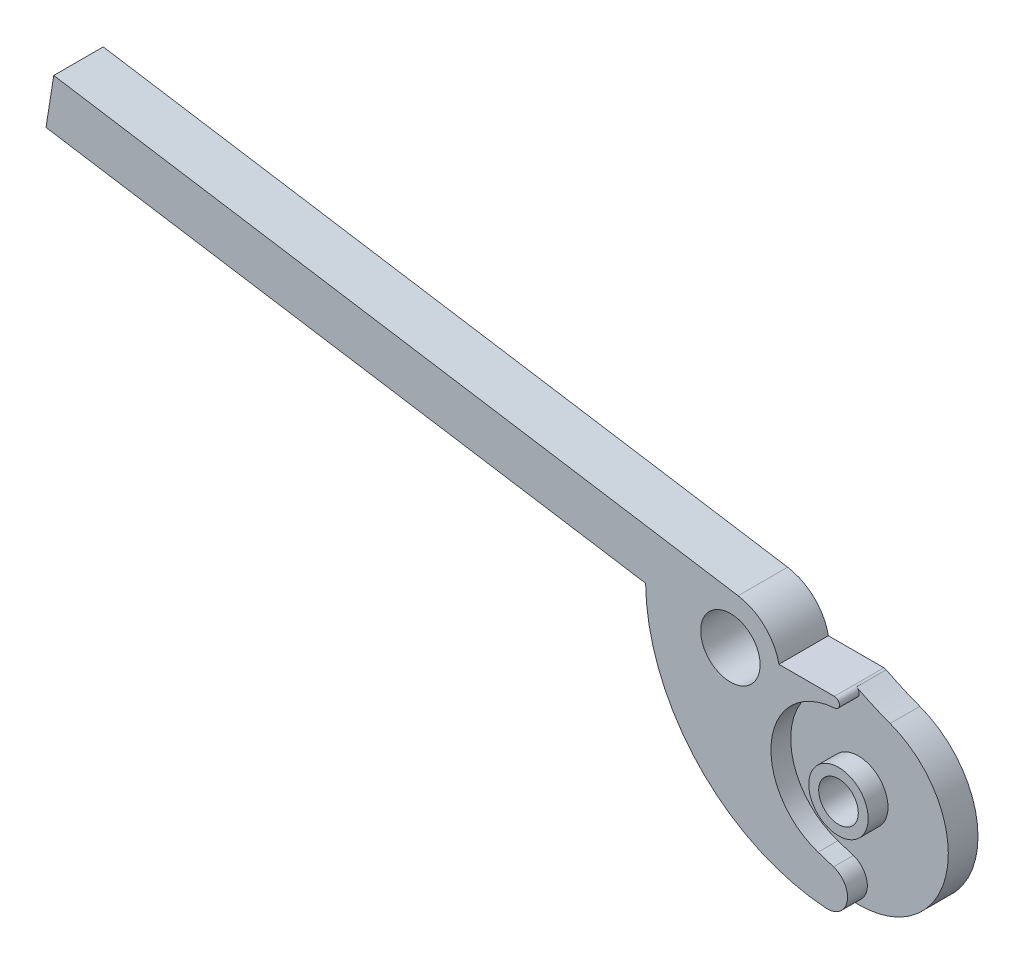
ISO-10303-21;
HEADER;
FILE_DESCRIPTION(('STEP AP214'),'2;1');
FILE_NAME('part.step','',(''),(''),'','','');
FILE_SCHEMA(('AUTOMOTIVE_DESIGN { 1 0 10303 214 1 1 1 1 }'));
ENDSEC;
DATA;
#1=APPLICATION_CONTEXT('core data for automotive mechanical design processes');
#2=APPLICATION_PROTOCOL_DEFINITION('international standard','automotive_design',2000,#1);
#3=PRODUCT_CONTEXT('',#1,'mechanical');
#4=PRODUCT('Part','Part','',(#3));
#5=PRODUCT_RELATED_PRODUCT_CATEGORY('part','',(#4));
#6=PRODUCT_DEFINITION_FORMATION('','',#4);
#7=PRODUCT_DEFINITION_CONTEXT('part definition',#1,'design');
#8=PRODUCT_DEFINITION('design','',#6,#7);
#9=PRODUCT_DEFINITION_SHAPE('','',#8);
#10=(LENGTH_UNIT() NAMED_UNIT(*) SI_UNIT(.MILLI.,.METRE.));
#11=(NAMED_UNIT(*) PLANE_ANGLE_UNIT() SI_UNIT($,.RADIAN.));
#12=(NAMED_UNIT(*) SI_UNIT($,.STERADIAN.) SOLID_ANGLE_UNIT());
#13=UNCERTAINTY_MEASURE_WITH_UNIT(LENGTH_MEASURE(1.E-05),#10,'distance_accuracy_value','');
#14=(GEOMETRIC_REPRESENTATION_CONTEXT(3) GLOBAL_UNCERTAINTY_ASSIGNED_CONTEXT((#13)) GLOBAL_UNIT_ASSIGNED_CONTEXT((#10,
#11,#12)) REPRESENTATION_CONTEXT('',''));
#15=CARTESIAN_POINT('',(0.,0.,0.));
#16=DIRECTION('',(0.,0.,1.));
#17=DIRECTION('',(1.,0.,0.));
#18=AXIS2_PLACEMENT_3D('',#15,#16,#17);
#19=CARTESIAN_POINT('',(10.5046799855272,1.,5.5));
#20=CARTESIAN_POINT('',(10.5046799855272,1.,5.33333333333337));
#21=CARTESIAN_POINT('',(10.5046799855272,1.,5.16666666666662));
#22=CARTESIAN_POINT('',(10.5046799855272,1.,4.33333333333353));
#23=CARTESIAN_POINT('',(10.5046799855257,1.,3.66666666666654));
#24=CARTESIAN_POINT('',(10.5046799855257,1.,2.00000000000019));
#25=CARTESIAN_POINT('',(10.5046799855272,1.,1.00000000000024));
#26=CARTESIAN_POINT('',(10.5046799855272,1.,-0.166666666666707));
#27=CARTESIAN_POINT('',(10.5046799855272,1.,-0.333333333333299));
#28=CARTESIAN_POINT('',(10.5046799855272,1.,-0.5));
#29=CARTESIAN_POINT('',(11.457550308396,1.,5.5));
#30=CARTESIAN_POINT('',(11.4575503083964,1.00000000000027,5.33333333333337));
#31=CARTESIAN_POINT('',(11.457550308396,1.,5.16666666666662));
#32=CARTESIAN_POINT('',(11.457550308396,1.,4.33333333333353));
#33=CARTESIAN_POINT('',(11.4575503083998,1.00000000000302,3.66666666666668));
#34=CARTESIAN_POINT('',(11.4575503083955,1.00000000000031,1.99999999999997));
#35=CARTESIAN_POINT('',(11.457550308396,1.,1.00000000000024));
#36=CARTESIAN_POINT('',(11.457550308396,1.,-0.166666666666707));
#37=CARTESIAN_POINT('',(11.457550308396,1.,-0.333333333333299));
#38=CARTESIAN_POINT('',(11.457550308396,1.,-0.5));
#39=CARTESIAN_POINT('',(11.4888094546071,0.047642547158838,5.5));
#40=CARTESIAN_POINT('',(11.4888094546075,0.0476425471586087,5.33333333333337));
#41=CARTESIAN_POINT('',(11.4888094546071,0.0476425471588407,5.16666666666662));
#42=CARTESIAN_POINT('',(11.4888094546071,0.0476425471588407,4.33333333333353));
#43=CARTESIAN_POINT('',(11.4888094546112,0.0476425471565166,3.66666666666668));
#44=CARTESIAN_POINT('',(11.4888094546069,0.0476425471588093,1.99999999999997));
#45=CARTESIAN_POINT('',(11.4888094546071,0.0476425471588407,0.999999999999809));
#46=CARTESIAN_POINT('',(11.4888094546071,0.0476425471588407,-0.166666666666635));
#47=CARTESIAN_POINT('',(11.4888094546071,0.047642547158838,-0.333333333333354));
#48=CARTESIAN_POINT('',(11.4888094546071,0.047642547158838,-0.5));
#49=CARTESIAN_POINT('',(10.5379900597574,-0.0148420956075897,5.5));
#50=CARTESIAN_POINT('',(10.5379900597574,-0.0148420956075897,5.33333333333337));
#51=CARTESIAN_POINT('',(10.5379900597574,-0.0148420956075897,5.16666666666662));
#52=CARTESIAN_POINT('',(10.5379900597574,-0.0148420956075897,4.33333333333353));
#53=CARTESIAN_POINT('',(10.537990059756,-0.014842095607679,3.66666666666654));
#54=CARTESIAN_POINT('',(10.537990059756,-0.014842095607679,2.00000000000019));
#55=CARTESIAN_POINT('',(10.5379900597574,-0.0148420956075897,0.999999999999809));
#56=CARTESIAN_POINT('',(10.5379900597574,-0.0148420956075897,-0.166666666666635));
#57=CARTESIAN_POINT('',(10.5379900597574,-0.0148420956075897,-0.333333333333354));
#58=CARTESIAN_POINT('',(10.5379900597574,-0.0148420956075897,-0.5));
#59=(BOUNDED_SURFACE() B_SPLINE_SURFACE(3,3,((#19,#20,#21,#22,#23,#24,#25,#26,#27,#28),(#29,#30,
#31,#32,#33,#34,#35,#36,#37,#38),(#39,#40,#41,#42,#43,#44,#45,#46,#47,#48),(#49,#50,#51,#52,#53,
#54,#55,#56,#57,#58)),.UNSPECIFIED.,.F.,.F.,.F.) B_SPLINE_SURFACE_WITH_KNOTS((4,4),(4,2,2,2,4),
(0.,1.),(-0.1,0.,0.4,1.,1.1),
.UNSPECIFIED.) GEOMETRIC_REPRESENTATION_ITEM() RATIONAL_B_SPLINE_SURFACE(((1.,1.,1.,1.,1.,1.,1.,
1.,1.,1.),(0.355203497937325,0.355203497937325,0.355203497937328,0.355203497937328,
0.355203497936103,0.355203497936103,0.355203497937328,0.355203497937328,0.355203497937325,
0.355203497937325),(0.355203497937325,0.355203497937325,0.355203497937328,0.355203497937328,
0.355203497936103,0.355203497936103,0.355203497937328,0.355203497937328,0.355203497937325,
0.355203497937325),(1.,1.,1.,1.,1.,1.,1.,1.,1.,1.))) REPRESENTATION_ITEM('') SURFACE());
#60=CARTESIAN_POINT('',(11.0126477001718,0.492032285355068,3.));
#61=CARTESIAN_POINT('',(11.0126720461336,0.520613569163821,3.));
#62=CARTESIAN_POINT('',(11.0102369510657,0.54918761351215,3.));
#63=CARTESIAN_POINT('',(11.0006285792469,0.605497666315707,3.));
#64=CARTESIAN_POINT('',(10.9934603071358,0.633234527611298,3.));
#65=CARTESIAN_POINT('',(10.9745620272241,0.687120499637045,3.));
#66=CARTESIAN_POINT('',(10.9628303017176,0.713269008213628,3.));
#67=CARTESIAN_POINT('',(10.9351405105057,0.763233953696368,3.));
#68=CARTESIAN_POINT('',(10.9191811647579,0.787049681284518,3.));
#69=CARTESIAN_POINT('',(10.8834804284271,0.831678055350861,3.));
#70=CARTESIAN_POINT('',(10.8637363997762,0.852488589249073,3.));
#71=CARTESIAN_POINT('',(10.8210566125792,0.890466626632306,3.));
#72=CARTESIAN_POINT('',(10.79812634039,0.907640266804967,3.));
#73=CARTESIAN_POINT('',(10.7623936414455,0.92998468909038,3.));
#74=CARTESIAN_POINT('',(10.750560128675,0.936738193239441,3.));
#75=CARTESIAN_POINT('',(10.7384789972324,0.942997052545422,3.));
#76=B_SPLINE_CURVE_WITH_KNOTS('',3,(#60,#61,#62,#63,#64,#65,#66,#67,#68,#69,#70,#71,#72,#73,#74,
#75),.UNSPECIFIED.,.F.,.F.,(4,2,2,2,2,2,2,4),(0.,0.085629934450926,0.171169472494531,
0.256741239237436,0.342338945145626,0.427996534308549,0.513508417367527,0.554336598478728),.UNSPECIFIED.);
#77=CARTESIAN_POINT('',(11.0126477001721,0.492032285355068,3.));
#78=VERTEX_POINT('',#77);
#79=CARTESIAN_POINT('',(10.7384789972323,0.942997052545513,3.));
#80=VERTEX_POINT('',#79);
#81=EDGE_CURVE('E57',#78,#80,#76,.T.);
#82=CARTESIAN_POINT('',(14.1358177985421,-0.559276776445756,-1.74999999999511));
#83=CARTESIAN_POINT('',(12.3905553142359,0.0864915375277733,-1.74999999999511));
#84=CARTESIAN_POINT('',(10.7384789972327,0.942997052545537,-1.74999999999511));
#85=CARTESIAN_POINT('',(14.1358177985421,-0.559276776445756,-1.33333333394917));
#86=CARTESIAN_POINT('',(12.3905553142359,0.0864915375277733,-1.33333333394917));
#87=CARTESIAN_POINT('',(10.7384789972327,0.942997052545537,-1.33333333394917));
#88=CARTESIAN_POINT('',(14.1358177985421,-0.559276776445756,-0.916666667903218));
#89=CARTESIAN_POINT('',(12.3905553142359,0.0864915375277733,-0.916666667903218));
#90=CARTESIAN_POINT('',(10.7384789972327,0.942997052545536,-0.916666667903218));
#91=CARTESIAN_POINT('',(14.1358177985421,-0.559276776445756,-0.50000000185727));
#92=CARTESIAN_POINT('',(12.3905553142359,0.0864915375277733,-0.50000000185727));
#93=CARTESIAN_POINT('',(10.7384789972327,0.942997052545535,-0.50000000185727));
#94=CARTESIAN_POINT('',(14.1358177985421,-0.559276776445761,-0.37500000123634));
#95=CARTESIAN_POINT('',(12.3905553142359,0.086491537527771,-0.375000001236232));
#96=CARTESIAN_POINT('',(10.7384789972327,0.942997052545535,-0.375000001236125));
#97=CARTESIAN_POINT('',(14.1358177985421,-0.559276776445761,-0.250000000615409));
#98=CARTESIAN_POINT('',(12.3905553142359,0.0864915375277712,-0.250000000615322));
#99=CARTESIAN_POINT('',(10.7384789972327,0.942997052545536,-0.250000000615235));
#100=CARTESIAN_POINT('',(14.135817798542,-0.559276776445734,0.416666666672484));
#101=CARTESIAN_POINT('',(12.3905553142358,0.0864915375277826,0.41666666667198));
#102=CARTESIAN_POINT('',(10.7384789972326,0.942997052545543,0.416666666671479));
#103=CARTESIAN_POINT('',(14.1358177985417,-0.559276776445626,0.958333333339447));
#104=CARTESIAN_POINT('',(12.3905553142355,0.0864915375278278,0.958333333336759));
#105=CARTESIAN_POINT('',(10.7384789972322,0.942997052545564,0.958333333334092));
#106=CARTESIAN_POINT('',(14.1358177985413,-0.559276776445486,2.13558266072813));
#107=CARTESIAN_POINT('',(12.390555314235,0.0864915375278828,2.1355826607236));
#108=CARTESIAN_POINT('',(10.7384789972317,0.942997052545577,2.1355826607191));
#109=CARTESIAN_POINT('',(14.1358177985413,-0.559276776445471,2.77116532144985));
#110=CARTESIAN_POINT('',(12.390555314235,0.0864915375278851,2.77116532144616));
#111=CARTESIAN_POINT('',(10.7384789972317,0.942997052545564,2.77116532144249));
#112=CARTESIAN_POINT('',(14.135817798542,-0.559276776445725,3.40674798217157));
#113=CARTESIAN_POINT('',(12.3905553142358,0.0864915375277699,3.40674798217546));
#114=CARTESIAN_POINT('',(10.7384789972327,0.942997052545485,3.40674798217932));
#115=(BOUNDED_SURFACE() B_SPLINE_SURFACE(3,2,((#82,#83,#84),(#85,#86,#87),(#88,#89,#90),(#91,
#92,#93),(#94,#95,#96),(#97,#98,#99),(#100,#101,#102),(#103,#104,#105),(#106,#107,#108),(#109,
#110,#111),(#112,#113,#114)),.UNSPECIFIED.,.F.,.F.,.F.) B_SPLINE_SURFACE_WITH_KNOTS((4,3,2,2,4),
(3,3),(0.,1.24999999813784,1.62500000000063,3.25000000000152,5.15674798216669),(0.,1.),
.UNSPECIFIED.) GEOMETRIC_REPRESENTATION_ITEM() RATIONAL_B_SPLINE_SURFACE(((1.,0.998081668670768,
1.),(1.,0.998081668670768,1.),(1.,0.998081668670768,1.),(1.,0.998081668670768,1.),(1.,
0.998081668670768,1.),(1.,0.998081668670768,1.),(1.,0.998081668670768,1.),(1.,0.998081668670767,
1.),(1.,0.998081668670767,1.),(1.,0.998081668670767,1.),(1.,0.998081668670768,1.))) REPRESENTATION_ITEM('') SURFACE());
#116=CARTESIAN_POINT('',(10.7384789972327,0.942997052545485,3.40674798217932));
#117=CARTESIAN_POINT('',(10.7384789972317,0.942997052545564,2.77116532144249));
#118=CARTESIAN_POINT('',(10.7384789972317,0.942997052545577,2.1355826607191));
#119=CARTESIAN_POINT('',(10.7384789972322,0.942997052545564,0.958333333334092));
#120=CARTESIAN_POINT('',(10.7384789972326,0.942997052545544,0.416666666671479));
#121=CARTESIAN_POINT('',(10.7384789972327,0.942997052545536,-0.250000000615235));
#122=CARTESIAN_POINT('',(10.7384789972327,0.942997052545535,-0.375000001236125));
#123=CARTESIAN_POINT('',(10.7384789972327,0.942997052545535,-0.50000000185727));
#124=CARTESIAN_POINT('',(10.7384789972327,0.942997052545536,-0.916666667903218));
#125=CARTESIAN_POINT('',(10.7384789972327,0.942997052545537,-1.33333333394917));
#126=CARTESIAN_POINT('',(10.7384789972327,0.942997052545537,-1.74999999999511));
#127=B_SPLINE_CURVE_WITH_KNOTS('',3,(#116,#117,#118,#119,#120,#121,#122,#123,#124,#125,#126),
.UNSPECIFIED.,.F.,.F.,(4,2,2,3,4),(0.,1.90674798216516,3.53174798216605,3.90674798402884,
5.15674798216669),.UNSPECIFIED.);
#128=CARTESIAN_POINT('',(10.738748516728,0.943498579805578,0.));
#129=VERTEX_POINT('',#128);
#130=EDGE_CURVE('E305',#80,#129,#127,.T.);
#131=CARTESIAN_POINT('',(10.5379900597574,-0.0148420956075897,0.));
#132=CARTESIAN_POINT('',(11.4888094546071,0.0476425471588407,0.));
#133=CARTESIAN_POINT('',(11.457550308396,1.,0.));
#134=CARTESIAN_POINT('',(10.5046799855272,1.,0.));
#135=(BOUNDED_CURVE() B_SPLINE_CURVE(3,(#131,#132,#133,#134),.UNSPECIFIED.,.F.,
.F.) B_SPLINE_CURVE_WITH_KNOTS((4,4),(0.,1.),
.UNSPECIFIED.) CURVE() GEOMETRIC_REPRESENTATION_ITEM() RATIONAL_B_SPLINE_CURVE((1.,
0.355203497937328,0.355203497937328,1.)) REPRESENTATION_ITEM(''));
#136=CARTESIAN_POINT('',(10.5046799855272,1.,0.));
#137=VERTEX_POINT('',#136);
#138=EDGE_CURVE('E329',#137,#129,#135,.F.);
#139=CARTESIAN_POINT('',(10.5046799855272,1.,-0.5));
#140=CARTESIAN_POINT('',(10.5046799855272,1.,-0.333333333333299));
#141=CARTESIAN_POINT('',(10.5046799855272,1.,-0.166666666666707));
#142=CARTESIAN_POINT('',(10.5046799855272,1.,1.00000000000024));
#143=CARTESIAN_POINT('',(10.5046799855257,1.,2.00000000000019));
#144=CARTESIAN_POINT('',(10.5046799855257,1.,3.66666666666654));
#145=CARTESIAN_POINT('',(10.5046799855272,1.,4.33333333333353));
#146=CARTESIAN_POINT('',(10.5046799855272,1.,5.16666666666662));
#147=CARTESIAN_POINT('',(10.5046799855272,1.,5.33333333333337));
#148=CARTESIAN_POINT('',(10.5046799855272,1.,5.5));
#149=(BOUNDED_CURVE() B_SPLINE_CURVE(3,(#139,#140,#141,#142,#143,#144,#145,#146,#147,#148),
.UNSPECIFIED.,.F.,.F.) B_SPLINE_CURVE_WITH_KNOTS((4,2,2,2,4),(-0.1,0.,0.6,1.,1.1),
.UNSPECIFIED.) CURVE() GEOMETRIC_REPRESENTATION_ITEM() RATIONAL_B_SPLINE_CURVE((1.,1.,1.,1.,1.,
1.,1.,1.,1.,1.)) REPRESENTATION_ITEM(''));
#150=CARTESIAN_POINT('',(10.5046799855272,1.,5.));
#151=VERTEX_POINT('',#150);
#152=EDGE_CURVE('E239',#151,#137,#149,.F.);
#153=CARTESIAN_POINT('',(10.5046799855272,1.,5.));
#154=CARTESIAN_POINT('',(11.457550308396,1.,5.));
#155=CARTESIAN_POINT('',(11.4888094546071,0.0476425471588407,5.));
#156=CARTESIAN_POINT('',(10.5379900597574,-0.0148420956075897,5.));
#157=(BOUNDED_CURVE() B_SPLINE_CURVE(3,(#153,#154,#155,#156),.UNSPECIFIED.,.F.,
.F.) B_SPLINE_CURVE_WITH_KNOTS((4,4),(0.,1.),
.UNSPECIFIED.) CURVE() GEOMETRIC_REPRESENTATION_ITEM() RATIONAL_B_SPLINE_CURVE((1.,
0.355203497937328,0.355203497937328,1.)) REPRESENTATION_ITEM(''));
#158=CARTESIAN_POINT('',(10.5379900597574,-0.0148420956075906,5.));
#159=VERTEX_POINT('',#158);
#160=EDGE_CURVE('E328',#159,#151,#157,.F.);
#161=CARTESIAN_POINT('',(10.5379900597574,-0.0148420956075897,5.5));
#162=CARTESIAN_POINT('',(10.5379900597574,-0.0148420956075897,5.33333333333337));
#163=CARTESIAN_POINT('',(10.5379900597574,-0.0148420956075897,5.16666666666662));
#164=CARTESIAN_POINT('',(10.5379900597574,-0.0148420956075897,4.33333333333353));
#165=CARTESIAN_POINT('',(10.537990059756,-0.014842095607679,3.66666666666654));
#166=CARTESIAN_POINT('',(10.537990059756,-0.014842095607679,2.00000000000019));
#167=CARTESIAN_POINT('',(10.5379900597574,-0.0148420956075897,0.999999999999809));
#168=CARTESIAN_POINT('',(10.5379900597574,-0.0148420956075897,-0.166666666666635));
#169=CARTESIAN_POINT('',(10.5379900597574,-0.0148420956075897,-0.333333333333354));
#170=CARTESIAN_POINT('',(10.5379900597574,-0.0148420956075897,-0.5));
#171=(BOUNDED_CURVE() B_SPLINE_CURVE(3,(#161,#162,#163,#164,#165,#166,#167,#168,#169,#170),
.UNSPECIFIED.,.F.,.F.) B_SPLINE_CURVE_WITH_KNOTS((4,2,2,2,4),(-0.1,0.,0.4,1.,1.1),
.UNSPECIFIED.) CURVE() GEOMETRIC_REPRESENTATION_ITEM() RATIONAL_B_SPLINE_CURVE((1.,1.,1.,1.,1.,
1.,1.,1.,1.,1.)) REPRESENTATION_ITEM(''));
#172=CARTESIAN_POINT('',(10.537990059756,-0.0148420956076799,3.));
#173=VERTEX_POINT('',#172);
#174=EDGE_CURVE('E190',#173,#159,#171,.F.);
#175=CARTESIAN_POINT('',(10.537990059756,-0.014842095607679,3.));
#176=CARTESIAN_POINT('',(11.4888094546095,0.0476425471574337,3.));
#177=CARTESIAN_POINT('',(11.4575503083981,1.00000000000194,3.));
#178=CARTESIAN_POINT('',(10.5046799855257,1.,3.));
#179=(BOUNDED_CURVE() B_SPLINE_CURVE(3,(#175,#176,#177,#178),.UNSPECIFIED.,.F.,
.F.) B_SPLINE_CURVE_WITH_KNOTS((4,4),(0.,1.),
.UNSPECIFIED.) CURVE() GEOMETRIC_REPRESENTATION_ITEM() RATIONAL_B_SPLINE_CURVE((1.,
0.355203497936103,0.355203497936103,1.)) REPRESENTATION_ITEM(''));
#180=EDGE_CURVE('E146',#78,#173,#179,.F.);
#181=ORIENTED_EDGE('',*,*,#81,.T.);
#182=ORIENTED_EDGE('',*,*,#130,.T.);
#183=ORIENTED_EDGE('',*,*,#138,.F.);
#184=ORIENTED_EDGE('',*,*,#152,.F.);
#185=ORIENTED_EDGE('',*,*,#160,.F.);
#186=ORIENTED_EDGE('',*,*,#174,.F.);
#187=ORIENTED_EDGE('',*,*,#180,.F.);
#188=EDGE_LOOP('',(#181,#182,#183,#184,#185,#186,#187));
#189=FACE_BOUND('',#188,.T.);
#190=ADVANCED_FACE('F37',(#189),#59,.T.);
#191=CARTESIAN_POINT('',(9.64478065841801,-17.9521633593195,0.599999999999996));
#192=CARTESIAN_POINT('',(9.64478066003469,-17.9521633594327,0.733333333333266));
#193=CARTESIAN_POINT('',(9.64478057665277,-17.9521633535936,0.866666666666747));
#194=CARTESIAN_POINT('',(9.64478058635408,-17.952163354273,1.66666666666625));
#195=CARTESIAN_POINT('',(9.64478070850488,-17.9521633628271,2.33333333333006));
#196=CARTESIAN_POINT('',(9.64478072467374,-17.9521633639594,3.66666666666994));
#197=CARTESIAN_POINT('',(9.64478070850496,-17.9521633628271,4.33333333333288));
#198=CARTESIAN_POINT('',(9.64478071820618,-17.9521633635064,5.13333333333342));
#199=CARTESIAN_POINT('',(9.64478071497263,-17.95216336328,5.2666666666666));
#200=CARTESIAN_POINT('',(9.64478071658931,-17.9521633633932,5.4));
#201=CARTESIAN_POINT('',(12.9059484225558,-18.1805399077442,0.599999999999996));
#202=CARTESIAN_POINT('',(12.9059484218212,-18.1805399058975,0.733333333333267));
#203=CARTESIAN_POINT('',(12.9059484597145,-18.180540001153,0.866666666503238));
#204=CARTESIAN_POINT('',(12.9059484553055,-18.1805399900674,1.66666666257853));
#205=CARTESIAN_POINT('',(12.9059483997936,-18.1805398505274,2.33333332924205));
#206=CARTESIAN_POINT('',(12.9059483924453,-18.1805398320514,3.66666666258192));
#207=CARTESIAN_POINT('',(12.9059483997925,-18.1805398505262,4.33333332924624));
#208=CARTESIAN_POINT('',(12.9059483953849,-18.180539839442,5.13333333316996));
#209=CARTESIAN_POINT('',(12.9059483968533,-18.1805398431361,5.2666666666666));
#210=CARTESIAN_POINT('',(12.9059483961196,-18.1805398412895,5.4));
#211=CARTESIAN_POINT('',(13.5298957680896,-14.9714807499354,0.599999999999996));
#212=CARTESIAN_POINT('',(13.5298957664414,-14.9714807501562,0.733333333333288));
#213=CARTESIAN_POINT('',(13.5298958514687,-14.9714807387453,0.866666666503209));
#214=CARTESIAN_POINT('',(13.5298958415731,-14.9714807400706,1.66666666257868));
#215=CARTESIAN_POINT('',(13.5298957170173,-14.9714807567913,2.3333333292448));
#216=CARTESIAN_POINT('',(13.5298957005235,-14.9714807590025,3.66666666257918));
#217=CARTESIAN_POINT('',(13.529895717015,-14.9714807567936,4.33333332924624));
#218=CARTESIAN_POINT('',(13.5298957071215,-14.9714807581176,5.13333333316996));
#219=CARTESIAN_POINT('',(13.5298957104184,-14.9714807576762,5.2666666666666));
#220=CARTESIAN_POINT('',(13.5298957087705,-14.9714807578969,5.4));
#221=CARTESIAN_POINT('',(10.4207450862522,-13.9612564820859,0.599999999999996));
#222=CARTESIAN_POINT('',(10.4207450871871,-13.9612564823897,0.733333333333309));
#223=CARTESIAN_POINT('',(10.4207450389671,-13.9612564667221,0.866666666666689));
#224=CARTESIAN_POINT('',(10.4207450445745,-13.961256468544,1.66666666666654));
#225=CARTESIAN_POINT('',(10.4207451152204,-13.9612564914982,2.33333333333353));
#226=CARTESIAN_POINT('',(10.420745124566,-13.9612564945348,3.66666666666647));
#227=CARTESIAN_POINT('',(10.4207451152204,-13.9612564914982,4.33333333333288));
#228=CARTESIAN_POINT('',(10.4207451208278,-13.9612564933202,5.13333333333342));
#229=CARTESIAN_POINT('',(10.4207451189588,-13.9612564927129,5.2666666666666));
#230=CARTESIAN_POINT('',(10.4207451198932,-13.9612564930165,5.4));
#231=(BOUNDED_SURFACE() B_SPLINE_SURFACE(3,3,((#191,#192,#193,#194,#195,#196,#197,#198,#199,
#200),(#201,#202,#203,#204,#205,#206,#207,#208,#209,#210),(#211,#212,#213,#214,#215,#216,#217,
#218,#219,#220),(#221,#222,#223,#224,#225,#226,#227,#228,#229,#230)),.UNSPECIFIED.,.F.,.F.,
.F.) B_SPLINE_SURFACE_WITH_KNOTS((4,4),(4,2,2,2,4),(0.,1.),(-1.2,-1.,0.,1.,1.2),
.UNSPECIFIED.) GEOMETRIC_REPRESENTATION_ITEM() RATIONAL_B_SPLINE_SURFACE(((1.,1.,1.,1.,1.,1.,1.,
1.,1.,1.),(0.414545892180012,0.414545892180012,0.414545879073667,0.41454588212385,
0.414545898781575,0.414545903865582,0.414545898782426,0.414545901831809,0.414545901323565,
0.414545901323565),(0.414545892180012,0.414545892180012,0.414545879073667,0.41454588212385,
0.414545898781575,0.414545903865582,0.414545898782426,0.414545901831809,0.414545901323565,
0.414545901323565),(1.,1.,1.,1.,1.,1.,1.,1.,1.,1.))) REPRESENTATION_ITEM('') SURFACE());
#232=CARTESIAN_POINT('',(10.4207450862522,-13.9612564820859,0.599999999999996));
#233=CARTESIAN_POINT('',(10.4207450871871,-13.9612564823897,0.733333333333309));
#234=CARTESIAN_POINT('',(10.4207450389671,-13.9612564667221,0.866666666666689));
#235=CARTESIAN_POINT('',(10.4207450445745,-13.961256468544,1.66666666666654));
#236=CARTESIAN_POINT('',(10.4207451152204,-13.9612564914982,2.33333333333353));
#237=CARTESIAN_POINT('',(10.420745124566,-13.9612564945348,3.66666666666647));
#238=CARTESIAN_POINT('',(10.4207451152204,-13.9612564914982,4.33333333333288));
#239=CARTESIAN_POINT('',(10.4207451208278,-13.9612564933202,5.13333333333342));
#240=CARTESIAN_POINT('',(10.4207451189588,-13.9612564927129,5.2666666666666));
#241=CARTESIAN_POINT('',(10.4207451198932,-13.9612564930165,5.4));
#242=(BOUNDED_CURVE() B_SPLINE_CURVE(3,(#232,#233,#234,#235,#236,#237,#238,#239,#240,#241),
.UNSPECIFIED.,.F.,.F.) B_SPLINE_CURVE_WITH_KNOTS((4,2,2,2,4),(-1.2,-1.,0.,1.,1.2),
.UNSPECIFIED.) CURVE() GEOMETRIC_REPRESENTATION_ITEM() RATIONAL_B_SPLINE_CURVE((1.,1.,1.,1.,1.,
1.,1.,1.,1.,1.)) REPRESENTATION_ITEM(''));
#243=CARTESIAN_POINT('',(10.4207451198932,-13.9612564930165,5.));
#244=VERTEX_POINT('',#243);
#245=CARTESIAN_POINT('',(10.4207451198932,-13.9612564930165,3.));
#246=VERTEX_POINT('',#245);
#247=EDGE_CURVE('E166',#244,#246,#242,.F.);
#248=CARTESIAN_POINT('',(10.4207451198932,-13.9612564930165,5.));
#249=CARTESIAN_POINT('',(13.5298957087704,-14.9714807578969,5.00000000000001));
#250=CARTESIAN_POINT('',(12.9059483961195,-18.1805398412894,5.00000000000001));
#251=CARTESIAN_POINT('',(9.64478071658931,-17.9521633633932,5.));
#252=(BOUNDED_CURVE() B_SPLINE_CURVE(3,(#248,#249,#250,#251),.UNSPECIFIED.,.F.,
.F.) B_SPLINE_CURVE_WITH_KNOTS((4,4),(0.,1.),
.UNSPECIFIED.) CURVE() GEOMETRIC_REPRESENTATION_ITEM() RATIONAL_B_SPLINE_CURVE((1.,
0.414545901323578,0.414545901323578,1.)) REPRESENTATION_ITEM(''));
#253=CARTESIAN_POINT('',(9.64478071658931,-17.9521633633932,5.));
#254=VERTEX_POINT('',#253);
#255=EDGE_CURVE('E334',#254,#244,#252,.F.);
#256=CARTESIAN_POINT('',(9.64478071658931,-17.9521633633932,5.4));
#257=CARTESIAN_POINT('',(9.64478071497263,-17.95216336328,5.2666666666666));
#258=CARTESIAN_POINT('',(9.64478071820618,-17.9521633635064,5.13333333333342));
#259=CARTESIAN_POINT('',(9.64478070850496,-17.9521633628271,4.33333333333288));
#260=CARTESIAN_POINT('',(9.64478072467374,-17.9521633639594,3.66666666666994));
#261=CARTESIAN_POINT('',(9.64478070850488,-17.9521633628271,2.33333333333006));
#262=CARTESIAN_POINT('',(9.64478058635408,-17.952163354273,1.66666666666625));
#263=CARTESIAN_POINT('',(9.64478057665277,-17.9521633535936,0.866666666666747));
#264=CARTESIAN_POINT('',(9.64478066003469,-17.9521633594327,0.733333333333266));
#265=CARTESIAN_POINT('',(9.64478065841801,-17.9521633593195,0.599999999999996));
#266=(BOUNDED_CURVE() B_SPLINE_CURVE(3,(#256,#257,#258,#259,#260,#261,#262,#263,#264,#265),
.UNSPECIFIED.,.F.,.F.) B_SPLINE_CURVE_WITH_KNOTS((4,2,2,2,4),(-1.2,-1.,0.,1.,1.2),
.UNSPECIFIED.) CURVE() GEOMETRIC_REPRESENTATION_ITEM() RATIONAL_B_SPLINE_CURVE((1.,1.,1.,1.,1.,
1.,1.,1.,1.,1.)) REPRESENTATION_ITEM(''));
#267=CARTESIAN_POINT('',(9.64478071658931,-17.9521633633932,3.));
#268=VERTEX_POINT('',#267);
#269=EDGE_CURVE('E336',#268,#254,#266,.F.);
#270=CARTESIAN_POINT('',(9.64478071658931,-17.9521633633932,3.));
#271=CARTESIAN_POINT('',(12.9059483961195,-18.1805398412894,3.));
#272=CARTESIAN_POINT('',(13.5298957087704,-14.9714807578969,3.));
#273=CARTESIAN_POINT('',(10.4207451198932,-13.9612564930165,3.));
#274=(BOUNDED_CURVE() B_SPLINE_CURVE(3,(#270,#271,#272,#273),.UNSPECIFIED.,.F.,
.F.) B_SPLINE_CURVE_WITH_KNOTS((4,4),(0.,1.),
.UNSPECIFIED.) CURVE() GEOMETRIC_REPRESENTATION_ITEM() RATIONAL_B_SPLINE_CURVE((1.,
0.414545901323578,0.414545901323578,1.)) REPRESENTATION_ITEM(''));
#275=EDGE_CURVE('E331',#246,#268,#274,.F.);
#276=ORIENTED_EDGE('',*,*,#247,.F.);
#277=ORIENTED_EDGE('',*,*,#255,.F.);
#278=ORIENTED_EDGE('',*,*,#269,.F.);
#279=ORIENTED_EDGE('',*,*,#275,.F.);
#280=EDGE_LOOP('',(#276,#277,#278,#279));
#281=FACE_BOUND('',#280,.T.);
#282=ADVANCED_FACE('F216',(#281),#231,.T.);
#283=CARTESIAN_POINT('',(0.,0.,5.));
#284=DIRECTION('',(0.,0.,1.));
#285=DIRECTION('',(1.,0.,0.));
#286=AXIS2_PLACEMENT_3D('',#283,#284,#285);
#287=PLANE('',#286);
#288=CARTESIAN_POINT('',(10.9901770859867,-6.89570394586117,5.));
#289=DIRECTION('',(0.,0.,1.));
#290=DIRECTION('',(1.,0.,0.));
#291=AXIS2_PLACEMENT_3D('',#288,#289,#290);
#292=CIRCLE('',#291,6.89570394586116);
#293=CARTESIAN_POINT('',(8.85928737853721,-13.4539081180146,5.));
#294=VERTEX_POINT('',#293);
#295=EDGE_CURVE('E157',#159,#294,#292,.T.);
#296=ORIENTED_EDGE('',*,*,#295,.F.);
#297=ORIENTED_EDGE('',*,*,#160,.T.);
#298=DIRECTION('',(-1.,0.,0.));
#299=VECTOR('',#298,1.);
#300=CARTESIAN_POINT('',(4.89897948556635,1.,5.));
#301=LINE('',#300,#299);
#302=CARTESIAN_POINT('',(4.89897948556635,1.,5.));
#303=VERTEX_POINT('',#302);
#304=EDGE_CURVE('E424',#151,#303,#301,.T.);
#305=ORIENTED_EDGE('',*,*,#304,.T.);
#306=CARTESIAN_POINT('',(0.,0.,5.));
#307=DIRECTION('',(0.,0.,1.));
#308=DIRECTION('',(1.,0.,0.));
#309=AXIS2_PLACEMENT_3D('',#306,#307,#308);
#310=CIRCLE('',#309,5.);
#311=CARTESIAN_POINT('',(0.782172325201121,4.93844170297569,5.));
#312=VERTEX_POINT('',#311);
#313=EDGE_CURVE('E421',#303,#312,#310,.T.);
#314=ORIENTED_EDGE('',*,*,#313,.T.);
#315=DIRECTION('',(-0.987688340595139,0.156434465040224,0.));
#316=VECTOR('',#315,1.);
#317=CARTESIAN_POINT('',(0.782172325201121,4.93844170297569,5.));
#318=LINE('',#317,#316);
#319=CARTESIAN_POINT('',(-68.3560115164586,15.8888542557914,5.));
#320=VERTEX_POINT('',#319);
#321=EDGE_CURVE('E441',#312,#320,#318,.T.);
#322=ORIENTED_EDGE('',*,*,#321,.T.);
#323=DIRECTION('',(-0.156434465040223,-0.987688340595139,0.));
#324=VECTOR('',#323,1.);
#325=CARTESIAN_POINT('',(-68.3560115164586,15.8888542557914,5.));
#326=LINE('',#325,#324);
#327=CARTESIAN_POINT('',(-69.1381838416597,10.9504125528157,5.));
#328=VERTEX_POINT('',#327);
#329=EDGE_CURVE('E444',#320,#328,#326,.T.);
#330=ORIENTED_EDGE('',*,*,#329,.T.);
#331=DIRECTION('',(0.987688340595139,-0.156434465040224,0.));
#332=VECTOR('',#331,1.);
#333=CARTESIAN_POINT('',(-8.56675988102472,1.35684146915073,5.));
#334=LINE('',#333,#332);
#335=CARTESIAN_POINT('',(-8.56675988102472,1.35684146915073,5.));
#336=VERTEX_POINT('',#335);
#337=EDGE_CURVE('E449',#328,#336,#334,.T.);
#338=ORIENTED_EDGE('',*,*,#337,.T.);
#339=CARTESIAN_POINT('',(11.0126477001721,1.58068712037968,5.));
#340=DIRECTION('',(0.,0.,1.));
#341=DIRECTION('',(1.,0.,0.));
#342=AXIS2_PLACEMENT_3D('',#339,#340,#341);
#343=CIRCLE('',#342,19.5806871203797);
#344=EDGE_CURVE('E349',#336,#254,#343,.T.);
#345=ORIENTED_EDGE('',*,*,#344,.T.);
#346=ORIENTED_EDGE('',*,*,#255,.T.);
#347=DIRECTION('',(0.951056516295153,-0.30901699437495,0.));
#348=VECTOR('',#347,1.);
#349=CARTESIAN_POINT('',(11.8359302630606,-14.4210780198478,5.));
#350=LINE('',#349,#348);
#351=EDGE_CURVE('E151',#294,#244,#350,.T.);
#352=ORIENTED_EDGE('',*,*,#351,.F.);
#353=EDGE_LOOP('',(#296,#297,#305,#314,#322,#330,#338,#345,#346,#352));
#354=FACE_BOUND('',#353,.T.);
#355=CARTESIAN_POINT('',(0.,0.,5.));
#356=DIRECTION('',(0.,0.,1.));
#357=DIRECTION('',(1.,0.,0.));
#358=AXIS2_PLACEMENT_3D('',#355,#356,#357);
#359=CIRCLE('',#358,3.);
#360=CARTESIAN_POINT('',(3.,0.,5.));
#361=VERTEX_POINT('',#360);
#362=EDGE_CURVE('E397',#361,#361,#359,.T.);
#363=ORIENTED_EDGE('',*,*,#362,.F.);
#364=EDGE_LOOP('',(#363));
#365=FACE_BOUND('',#364,.T.);
#366=ADVANCED_FACE('F212',(#354,#365),#287,.T.);
#367=CARTESIAN_POINT('',(0.,0.,0.));
#368=DIRECTION('',(0.,0.,1.));
#369=DIRECTION('',(1.,0.,0.));
#370=AXIS2_PLACEMENT_3D('',#367,#368,#369);
#371=PLANE('',#370);
#372=CARTESIAN_POINT('',(10.9191922223388,-7.99451124244576,0.));
#373=DIRECTION('',(0.,0.,1.));
#374=DIRECTION('',(1.,0.,0.));
#375=AXIS2_PLACEMENT_3D('',#372,#373,#374);
#376=CIRCLE('',#375,2.);
#377=CARTESIAN_POINT('',(12.9191922223388,-7.99451124244576,0.));
#378=VERTEX_POINT('',#377);
#379=EDGE_CURVE('E642',#378,#378,#376,.T.);
#380=ORIENTED_EDGE('',*,*,#379,.T.);
#381=EDGE_LOOP('',(#380));
#382=FACE_BOUND('',#381,.T.);
#383=DIRECTION('',(-1.,0.,0.));
#384=VECTOR('',#383,1.);
#385=CARTESIAN_POINT('',(4.89897948556635,1.,0.));
#386=LINE('',#385,#384);
#387=CARTESIAN_POINT('',(4.89897948556635,1.,0.));
#388=VERTEX_POINT('',#387);
#389=EDGE_CURVE('E414',#137,#388,#386,.T.);
#390=ORIENTED_EDGE('',*,*,#389,.F.);
#391=ORIENTED_EDGE('',*,*,#138,.T.);
#392=CARTESIAN_POINT('',(24.5463847931084,27.5764673020685,1.28569983217266E-13));
#393=DIRECTION('',(0.,0.,1.));
#394=DIRECTION('',(1.,0.,0.));
#395=AXIS2_PLACEMENT_3D('',#392,#393,#394);
#396=CIRCLE('',#395,30.);
#397=CARTESIAN_POINT('',(14.1358177985421,-0.559276776445754,0.));
#398=VERTEX_POINT('',#397);
#399=EDGE_CURVE('E51',#129,#398,#396,.T.);
#400=ORIENTED_EDGE('',*,*,#399,.T.);
#401=CARTESIAN_POINT('',(11.0126477001721,-9.,0.));
#402=DIRECTION('',(0.,0.,1.));
#403=DIRECTION('',(-1.,0.,0.));
#404=AXIS2_PLACEMENT_3D('',#401,#402,#403);
#405=CIRCLE('',#404,9.);
#406=CARTESIAN_POINT('',(11.0126477001721,-18.,0.));
#407=VERTEX_POINT('',#406);
#408=EDGE_CURVE('E412',#407,#398,#405,.T.);
#409=ORIENTED_EDGE('',*,*,#408,.F.);
#410=CARTESIAN_POINT('',(11.0126477001721,1.58068712037968,0.));
#411=DIRECTION('',(0.,0.,1.));
#412=DIRECTION('',(1.,0.,0.));
#413=AXIS2_PLACEMENT_3D('',#410,#411,#412);
#414=CIRCLE('',#413,19.5806871203797);
#415=CARTESIAN_POINT('',(-8.56675988102472,1.35684146915073,0.));
#416=VERTEX_POINT('',#415);
#417=EDGE_CURVE('E409',#416,#407,#414,.T.);
#418=ORIENTED_EDGE('',*,*,#417,.F.);
#419=DIRECTION('',(0.987688340595139,-0.156434465040224,0.));
#420=VECTOR('',#419,1.);
#421=CARTESIAN_POINT('',(-8.56675988102472,1.35684146915073,0.));
#422=LINE('',#421,#420);
#423=CARTESIAN_POINT('',(-69.1381838416597,10.9504125528157,0.));
#424=VERTEX_POINT('',#423);
#425=EDGE_CURVE('E407',#424,#416,#422,.T.);
#426=ORIENTED_EDGE('',*,*,#425,.F.);
#427=DIRECTION('',(-0.156434465040223,-0.987688340595139,0.));
#428=VECTOR('',#427,1.);
#429=CARTESIAN_POINT('',(-68.3560115164586,15.8888542557914,0.));
#430=LINE('',#429,#428);
#431=CARTESIAN_POINT('',(-68.3560115164586,15.8888542557914,0.));
#432=VERTEX_POINT('',#431);
#433=EDGE_CURVE('E399',#432,#424,#430,.T.);
#434=ORIENTED_EDGE('',*,*,#433,.F.);
#435=DIRECTION('',(-0.987688340595139,0.156434465040224,0.));
#436=VECTOR('',#435,1.);
#437=CARTESIAN_POINT('',(0.782172325201121,4.93844170297569,0.));
#438=LINE('',#437,#436);
#439=CARTESIAN_POINT('',(0.782172325201121,4.93844170297569,0.));
#440=VERTEX_POINT('',#439);
#441=EDGE_CURVE('E396',#440,#432,#438,.T.);
#442=ORIENTED_EDGE('',*,*,#441,.F.);
#443=CARTESIAN_POINT('',(0.,0.,0.));
#444=DIRECTION('',(0.,0.,1.));
#445=DIRECTION('',(1.,0.,0.));
#446=AXIS2_PLACEMENT_3D('',#443,#444,#445);
#447=CIRCLE('',#446,5.);
#448=EDGE_CURVE('E390',#388,#440,#447,.T.);
#449=ORIENTED_EDGE('',*,*,#448,.F.);
#450=EDGE_LOOP('',(#390,#391,#400,#409,#418,#426,#434,#442,#449));
#451=FACE_BOUND('',#450,.T.);
#452=CARTESIAN_POINT('',(0.,0.,0.));
#453=DIRECTION('',(0.,0.,1.));
#454=DIRECTION('',(1.,0.,0.));
#455=AXIS2_PLACEMENT_3D('',#452,#453,#454);
#456=CIRCLE('',#455,3.);
#457=CARTESIAN_POINT('',(3.,0.,0.));
#458=VERTEX_POINT('',#457);
#459=EDGE_CURVE('E161',#458,#458,#456,.T.);
#460=ORIENTED_EDGE('',*,*,#459,.T.);
#461=EDGE_LOOP('',(#460));
#462=FACE_BOUND('',#461,.T.);
#463=ADVANCED_FACE('F215',(#382,#451,#462),#371,.F.);
#464=CARTESIAN_POINT('',(0.,0.,5.));
#465=DIRECTION('',(0.,0.,-1.));
#466=DIRECTION('',(-1.,0.,0.));
#467=AXIS2_PLACEMENT_3D('',#464,#465,#466);
#468=CYLINDRICAL_SURFACE('',#467,5.);
#469=ORIENTED_EDGE('',*,*,#448,.T.);
#470=DIRECTION('',(0.,0.,-1.));
#471=VECTOR('',#470,1.);
#472=CARTESIAN_POINT('',(0.782172325201121,4.93844170297569,5.));
#473=LINE('',#472,#471);
#474=EDGE_CURVE('E393',#312,#440,#473,.T.);
#475=ORIENTED_EDGE('',*,*,#474,.F.);
#476=ORIENTED_EDGE('',*,*,#313,.F.);
#477=DIRECTION('',(0.,0.,-1.));
#478=VECTOR('',#477,1.);
#479=CARTESIAN_POINT('',(4.89897948556635,1.,5.));
#480=LINE('',#479,#478);
#481=EDGE_CURVE('E395',#303,#388,#480,.T.);
#482=ORIENTED_EDGE('',*,*,#481,.T.);
#483=EDGE_LOOP('',(#469,#475,#476,#482));
#484=FACE_BOUND('',#483,.T.);
#485=ADVANCED_FACE('F378',(#484),#468,.T.);
#486=CARTESIAN_POINT('',(0.782172325201121,4.93844170297569,5.));
#487=DIRECTION('',(-0.156434465040224,-0.987688340595139,0.));
#488=DIRECTION('',(0.987688340595139,-0.156434465040224,0.));
#489=AXIS2_PLACEMENT_3D('',#486,#487,#488);
#490=PLANE('',#489);
#491=ORIENTED_EDGE('',*,*,#441,.T.);
#492=DIRECTION('',(0.,0.,-1.));
#493=VECTOR('',#492,1.);
#494=CARTESIAN_POINT('',(-68.3560115164586,15.8888542557914,5.));
#495=LINE('',#494,#493);
#496=EDGE_CURVE('E481',#320,#432,#495,.T.);
#497=ORIENTED_EDGE('',*,*,#496,.F.);
#498=ORIENTED_EDGE('',*,*,#321,.F.);
#499=ORIENTED_EDGE('',*,*,#474,.T.);
#500=EDGE_LOOP('',(#491,#497,#498,#499));
#501=FACE_BOUND('',#500,.T.);
#502=ADVANCED_FACE('F375',(#501),#490,.F.);
#503=CARTESIAN_POINT('',(-68.3560115164586,15.8888542557914,5.));
#504=DIRECTION('',(0.987688340595139,-0.156434465040223,0.));
#505=DIRECTION('',(0.156434465040223,0.987688340595139,0.));
#506=AXIS2_PLACEMENT_3D('',#503,#504,#505);
#507=PLANE('',#506);
#508=ORIENTED_EDGE('',*,*,#433,.T.);
#509=DIRECTION('',(0.,0.,-1.));
#510=VECTOR('',#509,1.);
#511=CARTESIAN_POINT('',(-69.1381838416597,10.9504125528157,5.));
#512=LINE('',#511,#510);
#513=EDGE_CURVE('E456',#328,#424,#512,.T.);
#514=ORIENTED_EDGE('',*,*,#513,.F.);
#515=ORIENTED_EDGE('',*,*,#329,.F.);
#516=ORIENTED_EDGE('',*,*,#496,.T.);
#517=EDGE_LOOP('',(#508,#514,#515,#516));
#518=FACE_BOUND('',#517,.T.);
#519=ADVANCED_FACE('F371',(#518),#507,.F.);
#520=CARTESIAN_POINT('',(-8.56675988102472,1.35684146915073,5.));
#521=DIRECTION('',(0.156434465040224,0.987688340595139,0.));
#522=DIRECTION('',(-0.987688340595139,0.156434465040224,0.));
#523=AXIS2_PLACEMENT_3D('',#520,#521,#522);
#524=PLANE('',#523);
#525=ORIENTED_EDGE('',*,*,#425,.T.);
#526=DIRECTION('',(0.,0.,-1.));
#527=VECTOR('',#526,1.);
#528=CARTESIAN_POINT('',(-8.56675988102472,1.35684146915073,5.));
#529=LINE('',#528,#527);
#530=EDGE_CURVE('E454',#336,#416,#529,.T.);
#531=ORIENTED_EDGE('',*,*,#530,.F.);
#532=ORIENTED_EDGE('',*,*,#337,.F.);
#533=ORIENTED_EDGE('',*,*,#513,.T.);
#534=EDGE_LOOP('',(#525,#531,#532,#533));
#535=FACE_BOUND('',#534,.T.);
#536=ADVANCED_FACE('F367',(#535),#524,.F.);
#537=CARTESIAN_POINT('',(11.0126477001721,1.58068712037968,5.));
#538=DIRECTION('',(0.,0.,-1.));
#539=DIRECTION('',(-1.,0.,0.));
#540=AXIS2_PLACEMENT_3D('',#537,#538,#539);
#541=CYLINDRICAL_SURFACE('',#540,19.5806871203797);
#542=CARTESIAN_POINT('',(11.0126477001721,1.58068712037968,3.));
#543=DIRECTION('',(0.,0.,1.));
#544=DIRECTION('',(1.,0.,0.));
#545=AXIS2_PLACEMENT_3D('',#542,#543,#544);
#546=CIRCLE('',#545,19.5806871203797);
#547=CARTESIAN_POINT('',(11.0126477001721,-18.,3.));
#548=VERTEX_POINT('',#547);
#549=EDGE_CURVE('E339',#548,#268,#546,.F.);
#550=ORIENTED_EDGE('',*,*,#549,.T.);
#551=ORIENTED_EDGE('',*,*,#269,.T.);
#552=ORIENTED_EDGE('',*,*,#344,.F.);
#553=ORIENTED_EDGE('',*,*,#530,.T.);
#554=ORIENTED_EDGE('',*,*,#417,.T.);
#555=DIRECTION('',(0.,0.,-1.));
#556=VECTOR('',#555,1.);
#557=CARTESIAN_POINT('',(11.0126477001721,-18.,5.));
#558=LINE('',#557,#556);
#559=EDGE_CURVE('E457',#548,#407,#558,.T.);
#560=ORIENTED_EDGE('',*,*,#559,.F.);
#561=EDGE_LOOP('',(#550,#551,#552,#553,#554,#560));
#562=FACE_BOUND('',#561,.T.);
#563=ADVANCED_FACE('F357',(#562),#541,.T.);
#564=CARTESIAN_POINT('',(11.0126477001721,-9.,5.));
#565=DIRECTION('',(0.,0.,-1.));
#566=DIRECTION('',(-1.,0.,0.));
#567=AXIS2_PLACEMENT_3D('',#564,#565,#566);
#568=CYLINDRICAL_SURFACE('',#567,9.);
#569=ORIENTED_EDGE('',*,*,#408,.T.);
#570=CARTESIAN_POINT('',(14.1358177985421,-0.559276776445756,-1.74999999999511));
#571=CARTESIAN_POINT('',(14.1358177985421,-0.559276776445756,-1.33333333394917));
#572=CARTESIAN_POINT('',(14.1358177985421,-0.559276776445756,-0.916666667903218));
#573=CARTESIAN_POINT('',(14.1358177985421,-0.559276776445756,-0.50000000185727));
#574=CARTESIAN_POINT('',(14.1358177985421,-0.559276776445761,-0.37500000123634));
#575=CARTESIAN_POINT('',(14.1358177985421,-0.559276776445761,-0.25000000061541));
#576=CARTESIAN_POINT('',(14.135817798542,-0.559276776445734,0.416666666672484));
#577=CARTESIAN_POINT('',(14.1358177985417,-0.559276776445626,0.958333333339447));
#578=CARTESIAN_POINT('',(14.1358177985413,-0.559276776445486,2.13558266072813));
#579=CARTESIAN_POINT('',(14.1358177985413,-0.559276776445471,2.77116532144985));
#580=CARTESIAN_POINT('',(14.135817798542,-0.559276776445725,3.40674798217157));
#581=B_SPLINE_CURVE_WITH_KNOTS('',3,(#570,#571,#572,#573,#574,#575,#576,#577,#578,#579,#580),
.UNSPECIFIED.,.F.,.F.,(4,3,2,2,4),(0.,1.24999999813784,1.62500000000063,3.25000000000152,
5.15674798216669),.UNSPECIFIED.);
#582=CARTESIAN_POINT('',(14.1358177985417,-0.559276776445617,3.));
#583=VERTEX_POINT('',#582);
#584=EDGE_CURVE('E463',#398,#583,#581,.T.);
#585=ORIENTED_EDGE('',*,*,#584,.T.);
#586=CARTESIAN_POINT('',(11.0126477001721,-9.,3.));
#587=DIRECTION('',(0.,0.,1.));
#588=DIRECTION('',(1.,0.,0.));
#589=AXIS2_PLACEMENT_3D('',#586,#587,#588);
#590=CIRCLE('',#589,9.);
#591=EDGE_CURVE('E346',#548,#583,#590,.T.);
#592=ORIENTED_EDGE('',*,*,#591,.F.);
#593=ORIENTED_EDGE('',*,*,#559,.T.);
#594=EDGE_LOOP('',(#569,#585,#592,#593));
#595=FACE_BOUND('',#594,.T.);
#596=ADVANCED_FACE('F366',(#595),#568,.T.);
#597=CARTESIAN_POINT('',(4.89897948556635,1.,5.));
#598=DIRECTION('',(0.,-1.,0.));
#599=DIRECTION('',(0.,0.,-1.));
#600=AXIS2_PLACEMENT_3D('',#597,#598,#599);
#601=PLANE('',#600);
#602=ORIENTED_EDGE('',*,*,#304,.F.);
#603=ORIENTED_EDGE('',*,*,#152,.T.);
#604=ORIENTED_EDGE('',*,*,#389,.T.);
#605=ORIENTED_EDGE('',*,*,#481,.F.);
#606=EDGE_LOOP('',(#602,#603,#604,#605));
#607=FACE_BOUND('',#606,.T.);
#608=ADVANCED_FACE('F210',(#607),#601,.F.);
#609=CARTESIAN_POINT('',(0.,0.,5.));
#610=DIRECTION('',(0.,0.,-1.));
#611=DIRECTION('',(-1.,0.,0.));
#612=AXIS2_PLACEMENT_3D('',#609,#610,#611);
#613=CYLINDRICAL_SURFACE('',#612,3.);
#614=ORIENTED_EDGE('',*,*,#362,.T.);
#615=EDGE_LOOP('',(#614));
#616=FACE_BOUND('',#615,.T.);
#617=ORIENTED_EDGE('',*,*,#459,.F.);
#618=EDGE_LOOP('',(#617));
#619=FACE_BOUND('',#618,.T.);
#620=ADVANCED_FACE('F207',(#616,#619),#613,.F.);
#621=CARTESIAN_POINT('',(10.9901770859867,-6.89570394586117,3.));
#622=DIRECTION('',(0.,0.,1.));
#623=DIRECTION('',(1.,0.,0.));
#624=AXIS2_PLACEMENT_3D('',#621,#622,#623);
#625=PLANE('',#624);
#626=ORIENTED_EDGE('',*,*,#549,.F.);
#627=ORIENTED_EDGE('',*,*,#591,.T.);
#628=CARTESIAN_POINT('',(24.546384793107,27.5764673020689,3.00000000000001));
#629=DIRECTION('',(0.,0.,1.));
#630=DIRECTION('',(1.,0.,0.));
#631=AXIS2_PLACEMENT_3D('',#628,#629,#630);
#632=CIRCLE('',#631,30.);
#633=EDGE_CURVE('E11',#583,#80,#632,.F.);
#634=ORIENTED_EDGE('',*,*,#633,.T.);
#635=ORIENTED_EDGE('',*,*,#81,.F.);
#636=ORIENTED_EDGE('',*,*,#180,.T.);
#637=CARTESIAN_POINT('',(10.9901770859867,-6.89570394586117,3.));
#638=DIRECTION('',(0.,0.,1.));
#639=DIRECTION('',(1.,0.,0.));
#640=AXIS2_PLACEMENT_3D('',#637,#638,#639);
#641=CIRCLE('',#640,6.89570394586116);
#642=CARTESIAN_POINT('',(8.85928737853721,-13.4539081180146,3.));
#643=VERTEX_POINT('',#642);
#644=EDGE_CURVE('E139',#173,#643,#641,.T.);
#645=ORIENTED_EDGE('',*,*,#644,.T.);
#646=DIRECTION('',(0.951056516295153,-0.30901699437495,0.));
#647=VECTOR('',#646,1.);
#648=CARTESIAN_POINT('',(11.8359302630606,-14.4210780198478,3.));
#649=LINE('',#648,#647);
#650=EDGE_CURVE('E145',#643,#246,#649,.T.);
#651=ORIENTED_EDGE('',*,*,#650,.T.);
#652=ORIENTED_EDGE('',*,*,#275,.T.);
#653=EDGE_LOOP('',(#626,#627,#634,#635,#636,#645,#651,#652));
#654=FACE_BOUND('',#653,.T.);
#655=CARTESIAN_POINT('',(10.9191922223388,-7.99451124244576,3.));
#656=DIRECTION('',(0.,0.,1.));
#657=DIRECTION('',(1.,0.,0.));
#658=AXIS2_PLACEMENT_3D('',#655,#656,#657);
#659=CIRCLE('',#658,3.);
#660=CARTESIAN_POINT('',(13.9191922223388,-7.99451124244576,3.));
#661=VERTEX_POINT('',#660);
#662=EDGE_CURVE('E183',#661,#661,#659,.T.);
#663=ORIENTED_EDGE('',*,*,#662,.F.);
#664=EDGE_LOOP('',(#663));
#665=FACE_BOUND('',#664,.T.);
#666=ADVANCED_FACE('F142',(#654,#665),#625,.T.);
#667=CARTESIAN_POINT('',(10.9901770859867,-6.89570394586117,3.));
#668=DIRECTION('',(0.,0.,1.));
#669=DIRECTION('',(1.,0.,0.));
#670=AXIS2_PLACEMENT_3D('',#667,#668,#669);
#671=CYLINDRICAL_SURFACE('',#670,6.89570394586116);
#672=ORIENTED_EDGE('',*,*,#644,.F.);
#673=ORIENTED_EDGE('',*,*,#174,.T.);
#674=ORIENTED_EDGE('',*,*,#295,.T.);
#675=DIRECTION('',(0.,0.,1.));
#676=VECTOR('',#675,1.);
#677=CARTESIAN_POINT('',(8.85928737853721,-13.4539081180146,3.));
#678=LINE('',#677,#676);
#679=EDGE_CURVE('E154',#643,#294,#678,.T.);
#680=ORIENTED_EDGE('',*,*,#679,.F.);
#681=EDGE_LOOP('',(#672,#673,#674,#680));
#682=FACE_BOUND('',#681,.T.);
#683=ADVANCED_FACE('F155',(#682),#671,.F.);
#684=CARTESIAN_POINT('',(11.8359302630606,-14.4210780198478,3.));
#685=DIRECTION('',(-0.30901699437495,-0.951056516295153,0.));
#686=DIRECTION('',(0.951056516295153,-0.30901699437495,0.));
#687=AXIS2_PLACEMENT_3D('',#684,#685,#686);
#688=PLANE('',#687);
#689=ORIENTED_EDGE('',*,*,#351,.T.);
#690=ORIENTED_EDGE('',*,*,#247,.T.);
#691=ORIENTED_EDGE('',*,*,#650,.F.);
#692=ORIENTED_EDGE('',*,*,#679,.T.);
#693=EDGE_LOOP('',(#689,#690,#691,#692));
#694=FACE_BOUND('',#693,.T.);
#695=ADVANCED_FACE('F164',(#694),#688,.F.);
#696=CARTESIAN_POINT('',(10.9191922223388,-7.99451124244576,3.));
#697=DIRECTION('',(0.,0.,1.));
#698=DIRECTION('',(1.,0.,0.));
#699=AXIS2_PLACEMENT_3D('',#696,#697,#698);
#700=CYLINDRICAL_SURFACE('',#699,3.);
#701=ORIENTED_EDGE('',*,*,#662,.T.);
#702=EDGE_LOOP('',(#701));
#703=FACE_BOUND('',#702,.T.);
#704=CARTESIAN_POINT('',(10.9191922223388,-7.99451124244576,5.));
#705=DIRECTION('',(0.,0.,1.));
#706=DIRECTION('',(1.,0.,0.));
#707=AXIS2_PLACEMENT_3D('',#704,#705,#706);
#708=CIRCLE('',#707,3.);
#709=CARTESIAN_POINT('',(13.9191922223388,-7.99451124244576,5.));
#710=VERTEX_POINT('',#709);
#711=EDGE_CURVE('E640',#710,#710,#708,.T.);
#712=ORIENTED_EDGE('',*,*,#711,.F.);
#713=EDGE_LOOP('',(#712));
#714=FACE_BOUND('',#713,.T.);
#715=ADVANCED_FACE('F309',(#703,#714),#700,.T.);
#716=CARTESIAN_POINT('',(10.9191922223388,-7.99451124244576,5.));
#717=DIRECTION('',(0.,0.,1.));
#718=DIRECTION('',(1.,0.,0.));
#719=AXIS2_PLACEMENT_3D('',#716,#717,#718);
#720=CIRCLE('',#719,2.);
#721=CARTESIAN_POINT('',(12.9191922223388,-7.99451124244576,5.));
#722=VERTEX_POINT('',#721);
#723=EDGE_CURVE('E645',#722,#722,#720,.T.);
#724=ORIENTED_EDGE('',*,*,#723,.F.);
#725=EDGE_LOOP('',(#724));
#726=FACE_BOUND('',#725,.T.);
#727=ORIENTED_EDGE('',*,*,#711,.T.);
#728=EDGE_LOOP('',(#727));
#729=FACE_BOUND('',#728,.T.);
#730=ADVANCED_FACE('F218',(#726,#729),#287,.T.);
#731=ORIENTED_EDGE('',*,*,#633,.F.);
#732=ORIENTED_EDGE('',*,*,#584,.F.);
#733=ORIENTED_EDGE('',*,*,#399,.F.);
#734=ORIENTED_EDGE('',*,*,#130,.F.);
#735=EDGE_LOOP('',(#731,#732,#733,#734));
#736=FACE_BOUND('',#735,.T.);
#737=ADVANCED_FACE('F295',(#736),#115,.F.);
#738=CARTESIAN_POINT('',(10.9191922223388,-7.99451124244576,-0.0500000000007543));
#739=DIRECTION('',(0.,0.,1.));
#740=DIRECTION('',(1.,0.,0.));
#741=AXIS2_PLACEMENT_3D('',#738,#739,#740);
#742=CYLINDRICAL_SURFACE('',#741,2.);
#743=ORIENTED_EDGE('',*,*,#723,.T.);
#744=EDGE_LOOP('',(#743));
#745=FACE_BOUND('',#744,.T.);
#746=ORIENTED_EDGE('',*,*,#379,.F.);
#747=EDGE_LOOP('',(#746));
#748=FACE_BOUND('',#747,.T.);
#749=ADVANCED_FACE('F555',(#745,#748),#742,.F.);
#750=CLOSED_SHELL('',(#190,#282,#366,#463,#485,#502,#519,#536,#563,#596,#608,#620,#666,#683,
#695,#715,#730,#737,#749));
#751=MANIFOLD_SOLID_BREP('B2',#750);
#752=ADVANCED_BREP_SHAPE_REPRESENTATION('',(#18,#751),#14);
#753=SHAPE_DEFINITION_REPRESENTATION(#9,#752);
ENDSEC;
END-ISO-10303-21;
